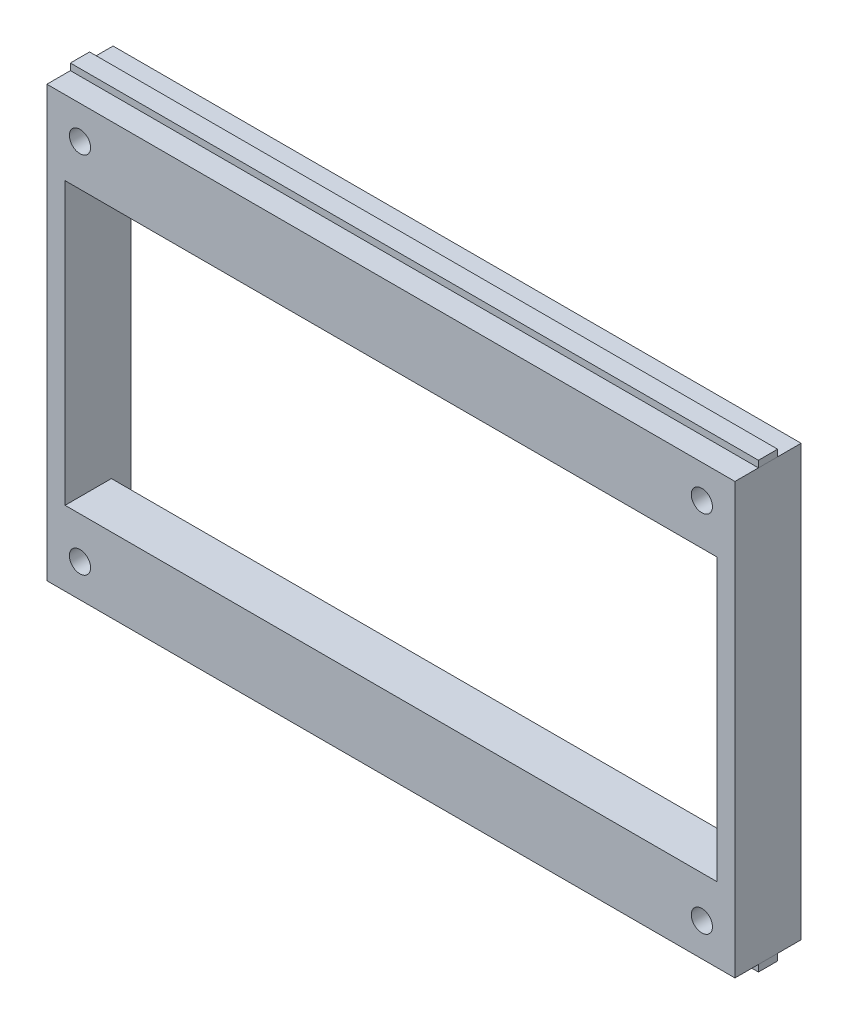
ISO-10303-21;
HEADER;
FILE_DESCRIPTION(('STEP AP214'),'2;1');
FILE_NAME('part.step','',(''),(''),'','','');
FILE_SCHEMA(('AUTOMOTIVE_DESIGN { 1 0 10303 214 1 1 1 1 }'));
ENDSEC;
DATA;
#1=APPLICATION_CONTEXT('core data for automotive mechanical design processes');
#2=APPLICATION_PROTOCOL_DEFINITION('international standard','automotive_design',2000,#1);
#3=PRODUCT_CONTEXT('',#1,'mechanical');
#4=PRODUCT('Part','Part','',(#3));
#5=PRODUCT_RELATED_PRODUCT_CATEGORY('part','',(#4));
#6=PRODUCT_DEFINITION_FORMATION('','',#4);
#7=PRODUCT_DEFINITION_CONTEXT('part definition',#1,'design');
#8=PRODUCT_DEFINITION('design','',#6,#7);
#9=PRODUCT_DEFINITION_SHAPE('','',#8);
#10=(LENGTH_UNIT() NAMED_UNIT(*) SI_UNIT(.MILLI.,.METRE.));
#11=(NAMED_UNIT(*) PLANE_ANGLE_UNIT() SI_UNIT($,.RADIAN.));
#12=(NAMED_UNIT(*) SI_UNIT($,.STERADIAN.) SOLID_ANGLE_UNIT());
#13=UNCERTAINTY_MEASURE_WITH_UNIT(LENGTH_MEASURE(1.E-05),#10,'distance_accuracy_value','');
#14=(GEOMETRIC_REPRESENTATION_CONTEXT(3) GLOBAL_UNCERTAINTY_ASSIGNED_CONTEXT((#13)) GLOBAL_UNIT_ASSIGNED_CONTEXT((#10,
#11,#12)) REPRESENTATION_CONTEXT('',''));
#15=CARTESIAN_POINT('',(0.,0.,0.));
#16=DIRECTION('',(0.,0.,1.));
#17=DIRECTION('',(1.,0.,0.));
#18=AXIS2_PLACEMENT_3D('',#15,#16,#17);
#19=CARTESIAN_POINT('',(55.0675723300356,-32.5,3.55000000000001));
#20=DIRECTION('',(0.,0.,-1.));
#21=DIRECTION('',(0.,1.,0.));
#22=AXIS2_PLACEMENT_3D('',#19,#20,#21);
#23=PLANE('',#22);
#24=DIRECTION('',(0.,1.,0.));
#25=VECTOR('',#24,1.);
#26=CARTESIAN_POINT('',(52.,-32.5,3.55000000000001));
#27=LINE('',#26,#25);
#28=CARTESIAN_POINT('',(52.,-33.5,3.55000000000001));
#29=VERTEX_POINT('',#28);
#30=CARTESIAN_POINT('',(52.,-32.5,3.55000000000001));
#31=VERTEX_POINT('',#30);
#32=EDGE_CURVE('E54',#29,#31,#27,.T.);
#33=ORIENTED_EDGE('',*,*,#32,.F.);
#34=DIRECTION('',(-1.,0.,0.));
#35=VECTOR('',#34,1.);
#36=CARTESIAN_POINT('',(55.0675723300356,-33.5,3.55000000000001));
#37=LINE('',#36,#35);
#38=CARTESIAN_POINT('',(-52.,-33.5,3.55000000000001));
#39=VERTEX_POINT('',#38);
#40=EDGE_CURVE('E82',#29,#39,#37,.T.);
#41=ORIENTED_EDGE('',*,*,#40,.T.);
#42=DIRECTION('',(0.,-1.,0.));
#43=VECTOR('',#42,1.);
#44=CARTESIAN_POINT('',(-52.,-32.5,3.55000000000001));
#45=LINE('',#44,#43);
#46=CARTESIAN_POINT('',(-52.,-32.5,3.55000000000001));
#47=VERTEX_POINT('',#46);
#48=EDGE_CURVE('E86',#47,#39,#45,.T.);
#49=ORIENTED_EDGE('',*,*,#48,.F.);
#50=DIRECTION('',(-1.,0.,0.));
#51=VECTOR('',#50,1.);
#52=CARTESIAN_POINT('',(55.0675723300356,-32.5,3.55000000000001));
#53=LINE('',#52,#51);
#54=EDGE_CURVE('E109',#31,#47,#53,.T.);
#55=ORIENTED_EDGE('',*,*,#54,.F.);
#56=EDGE_LOOP('',(#33,#41,#49,#55));
#57=FACE_BOUND('',#56,.T.);
#58=ADVANCED_FACE('F46',(#57),#23,.T.);
#59=CARTESIAN_POINT('',(55.0675723300356,-32.5,3.55000000000001));
#60=DIRECTION('',(0.,1.,0.));
#61=DIRECTION('',(-1.,0.,0.));
#62=AXIS2_PLACEMENT_3D('',#59,#60,#61);
#63=PLANE('',#62);
#64=DIRECTION('',(0.,0.,1.));
#65=VECTOR('',#64,1.);
#66=CARTESIAN_POINT('',(52.,-32.5,3.55000000000001));
#67=LINE('',#66,#65);
#68=CARTESIAN_POINT('',(52.,-32.5,6.45000000000001));
#69=VERTEX_POINT('',#68);
#70=EDGE_CURVE('E60',#31,#69,#67,.T.);
#71=ORIENTED_EDGE('',*,*,#70,.F.);
#72=ORIENTED_EDGE('',*,*,#54,.T.);
#73=DIRECTION('',(0.,0.,-1.));
#74=VECTOR('',#73,1.);
#75=CARTESIAN_POINT('',(-52.,-32.5,3.55000000000001));
#76=LINE('',#75,#74);
#77=CARTESIAN_POINT('',(-52.,-32.5,6.45000000000001));
#78=VERTEX_POINT('',#77);
#79=EDGE_CURVE('E91',#78,#47,#76,.T.);
#80=ORIENTED_EDGE('',*,*,#79,.F.);
#81=DIRECTION('',(-1.,0.,0.));
#82=VECTOR('',#81,1.);
#83=CARTESIAN_POINT('',(55.0675723300356,-32.5,6.45000000000001));
#84=LINE('',#83,#82);
#85=EDGE_CURVE('E112',#69,#78,#84,.T.);
#86=ORIENTED_EDGE('',*,*,#85,.F.);
#87=EDGE_LOOP('',(#71,#72,#80,#86));
#88=FACE_BOUND('',#87,.T.);
#89=ADVANCED_FACE('F118',(#88),#63,.T.);
#90=CARTESIAN_POINT('',(55.0675723300356,-32.5,6.45000000000001));
#91=DIRECTION('',(0.,0.,1.));
#92=DIRECTION('',(1.,0.,0.));
#93=AXIS2_PLACEMENT_3D('',#90,#91,#92);
#94=PLANE('',#93);
#95=DIRECTION('',(0.,-1.,0.));
#96=VECTOR('',#95,1.);
#97=CARTESIAN_POINT('',(52.,-32.5,6.45000000000001));
#98=LINE('',#97,#96);
#99=CARTESIAN_POINT('',(52.,-33.5,6.45000000000001));
#100=VERTEX_POINT('',#99);
#101=EDGE_CURVE('E111',#69,#100,#98,.T.);
#102=ORIENTED_EDGE('',*,*,#101,.F.);
#103=ORIENTED_EDGE('',*,*,#85,.T.);
#104=DIRECTION('',(0.,1.,0.));
#105=VECTOR('',#104,1.);
#106=CARTESIAN_POINT('',(-52.,-32.5,6.45000000000001));
#107=LINE('',#106,#105);
#108=CARTESIAN_POINT('',(-52.,-33.5,6.45000000000001));
#109=VERTEX_POINT('',#108);
#110=EDGE_CURVE('E99',#109,#78,#107,.T.);
#111=ORIENTED_EDGE('',*,*,#110,.F.);
#112=DIRECTION('',(-1.,0.,0.));
#113=VECTOR('',#112,1.);
#114=CARTESIAN_POINT('',(55.0675723300356,-33.5,6.45000000000001));
#115=LINE('',#114,#113);
#116=EDGE_CURVE('E90',#100,#109,#115,.T.);
#117=ORIENTED_EDGE('',*,*,#116,.F.);
#118=EDGE_LOOP('',(#102,#103,#111,#117));
#119=FACE_BOUND('',#118,.T.);
#120=ADVANCED_FACE('F116',(#119),#94,.T.);
#121=CARTESIAN_POINT('',(55.0675723300356,-33.5,3.55000000000001));
#122=DIRECTION('',(0.,-1.,0.));
#123=DIRECTION('',(1.,0.,0.));
#124=AXIS2_PLACEMENT_3D('',#121,#122,#123);
#125=PLANE('',#124);
#126=DIRECTION('',(0.,0.,-1.));
#127=VECTOR('',#126,1.);
#128=CARTESIAN_POINT('',(52.,-33.5,3.55000000000001));
#129=LINE('',#128,#127);
#130=EDGE_CURVE('E13',#100,#29,#129,.T.);
#131=ORIENTED_EDGE('',*,*,#130,.F.);
#132=ORIENTED_EDGE('',*,*,#116,.T.);
#133=DIRECTION('',(0.,0.,1.));
#134=VECTOR('',#133,1.);
#135=CARTESIAN_POINT('',(-52.,-33.5,3.55000000000001));
#136=LINE('',#135,#134);
#137=EDGE_CURVE('E93',#39,#109,#136,.T.);
#138=ORIENTED_EDGE('',*,*,#137,.F.);
#139=ORIENTED_EDGE('',*,*,#40,.F.);
#140=EDGE_LOOP('',(#131,#132,#138,#139));
#141=FACE_BOUND('',#140,.T.);
#142=ADVANCED_FACE('F94',(#141),#125,.T.);
#143=CARTESIAN_POINT('',(-52.,0.,0.));
#144=DIRECTION('',(-1.,0.,0.));
#145=DIRECTION('',(0.,0.,1.));
#146=AXIS2_PLACEMENT_3D('',#143,#144,#145);
#147=PLANE('',#146);
#148=ORIENTED_EDGE('',*,*,#48,.T.);
#149=ORIENTED_EDGE('',*,*,#137,.T.);
#150=ORIENTED_EDGE('',*,*,#110,.T.);
#151=ORIENTED_EDGE('',*,*,#79,.T.);
#152=EDGE_LOOP('',(#148,#149,#150,#151));
#153=FACE_BOUND('',#152,.T.);
#154=ADVANCED_FACE('F101',(#153),#147,.T.);
#155=CARTESIAN_POINT('',(52.,32.5,10.));
#156=DIRECTION('',(-1.,0.,0.));
#157=DIRECTION('',(0.,0.,1.));
#158=AXIS2_PLACEMENT_3D('',#155,#156,#157);
#159=PLANE('',#158);
#160=ORIENTED_EDGE('',*,*,#32,.T.);
#161=ORIENTED_EDGE('',*,*,#70,.T.);
#162=ORIENTED_EDGE('',*,*,#101,.T.);
#163=ORIENTED_EDGE('',*,*,#130,.T.);
#164=EDGE_LOOP('',(#160,#161,#162,#163));
#165=FACE_BOUND('',#164,.T.);
#166=ADVANCED_FACE('F120',(#165),#159,.F.);
#167=CLOSED_SHELL('',(#58,#89,#120,#142,#154,#166));
#168=MANIFOLD_SOLID_BREP('B2',#167);
#169=CARTESIAN_POINT('',(55.0675723300356,33.5,6.45));
#170=DIRECTION('',(0.,0.,1.));
#171=DIRECTION('',(0.,-1.,0.));
#172=AXIS2_PLACEMENT_3D('',#169,#170,#171);
#173=PLANE('',#172);
#174=DIRECTION('',(0.,-1.,0.));
#175=VECTOR('',#174,1.);
#176=CARTESIAN_POINT('',(52.,33.5,6.45));
#177=LINE('',#176,#175);
#178=CARTESIAN_POINT('',(52.,33.5,6.45));
#179=VERTEX_POINT('',#178);
#180=CARTESIAN_POINT('',(52.,32.5,6.45));
#181=VERTEX_POINT('',#180);
#182=EDGE_CURVE('E187',#179,#181,#177,.T.);
#183=ORIENTED_EDGE('',*,*,#182,.F.);
#184=DIRECTION('',(-1.,0.,0.));
#185=VECTOR('',#184,1.);
#186=CARTESIAN_POINT('',(55.0675723300356,33.5,6.45));
#187=LINE('',#186,#185);
#188=CARTESIAN_POINT('',(-52.,33.5,6.45));
#189=VERTEX_POINT('',#188);
#190=EDGE_CURVE('E215',#179,#189,#187,.T.);
#191=ORIENTED_EDGE('',*,*,#190,.T.);
#192=DIRECTION('',(0.,1.,0.));
#193=VECTOR('',#192,1.);
#194=CARTESIAN_POINT('',(-52.,33.5,6.45));
#195=LINE('',#194,#193);
#196=CARTESIAN_POINT('',(-52.,32.5,6.45));
#197=VERTEX_POINT('',#196);
#198=EDGE_CURVE('E219',#197,#189,#195,.T.);
#199=ORIENTED_EDGE('',*,*,#198,.F.);
#200=DIRECTION('',(-1.,0.,0.));
#201=VECTOR('',#200,1.);
#202=CARTESIAN_POINT('',(55.0675723300356,32.5,6.45));
#203=LINE('',#202,#201);
#204=EDGE_CURVE('E242',#181,#197,#203,.T.);
#205=ORIENTED_EDGE('',*,*,#204,.F.);
#206=EDGE_LOOP('',(#183,#191,#199,#205));
#207=FACE_BOUND('',#206,.T.);
#208=ADVANCED_FACE('F179',(#207),#173,.T.);
#209=CARTESIAN_POINT('',(55.0675723300356,32.5,6.45));
#210=DIRECTION('',(0.,-1.,0.));
#211=DIRECTION('',(1.,0.,0.));
#212=AXIS2_PLACEMENT_3D('',#209,#210,#211);
#213=PLANE('',#212);
#214=DIRECTION('',(0.,0.,-1.));
#215=VECTOR('',#214,1.);
#216=CARTESIAN_POINT('',(52.,32.5,6.45));
#217=LINE('',#216,#215);
#218=CARTESIAN_POINT('',(52.,32.5,3.55));
#219=VERTEX_POINT('',#218);
#220=EDGE_CURVE('E193',#181,#219,#217,.T.);
#221=ORIENTED_EDGE('',*,*,#220,.F.);
#222=ORIENTED_EDGE('',*,*,#204,.T.);
#223=DIRECTION('',(0.,0.,1.));
#224=VECTOR('',#223,1.);
#225=CARTESIAN_POINT('',(-52.,32.5,6.45));
#226=LINE('',#225,#224);
#227=CARTESIAN_POINT('',(-52.,32.5,3.55));
#228=VERTEX_POINT('',#227);
#229=EDGE_CURVE('E224',#228,#197,#226,.T.);
#230=ORIENTED_EDGE('',*,*,#229,.F.);
#231=DIRECTION('',(-1.,0.,0.));
#232=VECTOR('',#231,1.);
#233=CARTESIAN_POINT('',(55.0675723300356,32.5,3.55));
#234=LINE('',#233,#232);
#235=EDGE_CURVE('E245',#219,#228,#234,.T.);
#236=ORIENTED_EDGE('',*,*,#235,.F.);
#237=EDGE_LOOP('',(#221,#222,#230,#236));
#238=FACE_BOUND('',#237,.T.);
#239=ADVANCED_FACE('F251',(#238),#213,.T.);
#240=CARTESIAN_POINT('',(55.0675723300356,33.5,3.55));
#241=DIRECTION('',(0.,0.,-1.));
#242=DIRECTION('',(-1.,0.,0.));
#243=AXIS2_PLACEMENT_3D('',#240,#241,#242);
#244=PLANE('',#243);
#245=DIRECTION('',(0.,1.,0.));
#246=VECTOR('',#245,1.);
#247=CARTESIAN_POINT('',(52.,33.5,3.55));
#248=LINE('',#247,#246);
#249=CARTESIAN_POINT('',(52.,33.5,3.55));
#250=VERTEX_POINT('',#249);
#251=EDGE_CURVE('E244',#219,#250,#248,.T.);
#252=ORIENTED_EDGE('',*,*,#251,.F.);
#253=ORIENTED_EDGE('',*,*,#235,.T.);
#254=DIRECTION('',(0.,-1.,0.));
#255=VECTOR('',#254,1.);
#256=CARTESIAN_POINT('',(-52.,33.5,3.55));
#257=LINE('',#256,#255);
#258=CARTESIAN_POINT('',(-52.,33.5,3.55));
#259=VERTEX_POINT('',#258);
#260=EDGE_CURVE('E232',#259,#228,#257,.T.);
#261=ORIENTED_EDGE('',*,*,#260,.F.);
#262=DIRECTION('',(-1.,0.,0.));
#263=VECTOR('',#262,1.);
#264=CARTESIAN_POINT('',(55.0675723300356,33.5,3.55));
#265=LINE('',#264,#263);
#266=EDGE_CURVE('E223',#250,#259,#265,.T.);
#267=ORIENTED_EDGE('',*,*,#266,.F.);
#268=EDGE_LOOP('',(#252,#253,#261,#267));
#269=FACE_BOUND('',#268,.T.);
#270=ADVANCED_FACE('F249',(#269),#244,.T.);
#271=CARTESIAN_POINT('',(55.0675723300356,33.5,6.45));
#272=DIRECTION('',(0.,1.,0.));
#273=DIRECTION('',(-1.,0.,0.));
#274=AXIS2_PLACEMENT_3D('',#271,#272,#273);
#275=PLANE('',#274);
#276=DIRECTION('',(0.,0.,1.));
#277=VECTOR('',#276,1.);
#278=CARTESIAN_POINT('',(52.,33.5,6.45));
#279=LINE('',#278,#277);
#280=EDGE_CURVE('E44',#250,#179,#279,.T.);
#281=ORIENTED_EDGE('',*,*,#280,.F.);
#282=ORIENTED_EDGE('',*,*,#266,.T.);
#283=DIRECTION('',(0.,0.,-1.));
#284=VECTOR('',#283,1.);
#285=CARTESIAN_POINT('',(-52.,33.5,6.45));
#286=LINE('',#285,#284);
#287=EDGE_CURVE('E226',#189,#259,#286,.T.);
#288=ORIENTED_EDGE('',*,*,#287,.F.);
#289=ORIENTED_EDGE('',*,*,#190,.F.);
#290=EDGE_LOOP('',(#281,#282,#288,#289));
#291=FACE_BOUND('',#290,.T.);
#292=ADVANCED_FACE('F227',(#291),#275,.T.);
#293=CARTESIAN_POINT('',(-52.,0.,0.));
#294=DIRECTION('',(1.,0.,0.));
#295=DIRECTION('',(0.,0.,-1.));
#296=AXIS2_PLACEMENT_3D('',#293,#294,#295);
#297=PLANE('',#296);
#298=ORIENTED_EDGE('',*,*,#198,.T.);
#299=ORIENTED_EDGE('',*,*,#287,.T.);
#300=ORIENTED_EDGE('',*,*,#260,.T.);
#301=ORIENTED_EDGE('',*,*,#229,.T.);
#302=EDGE_LOOP('',(#298,#299,#300,#301));
#303=FACE_BOUND('',#302,.T.);
#304=ADVANCED_FACE('F234',(#303),#297,.F.);
#305=CARTESIAN_POINT('',(52.,32.5,10.));
#306=DIRECTION('',(-1.,0.,0.));
#307=DIRECTION('',(0.,0.,1.));
#308=AXIS2_PLACEMENT_3D('',#305,#306,#307);
#309=PLANE('',#308);
#310=ORIENTED_EDGE('',*,*,#182,.T.);
#311=ORIENTED_EDGE('',*,*,#220,.T.);
#312=ORIENTED_EDGE('',*,*,#251,.T.);
#313=ORIENTED_EDGE('',*,*,#280,.T.);
#314=EDGE_LOOP('',(#310,#311,#312,#313));
#315=FACE_BOUND('',#314,.T.);
#316=ADVANCED_FACE('F253',(#315),#309,.F.);
#317=CLOSED_SHELL('',(#208,#239,#270,#292,#304,#316));
#318=MANIFOLD_SOLID_BREP('B7',#317);
#319=CARTESIAN_POINT('',(-49.25,21.25,0.));
#320=DIRECTION('',(0.,1.,0.));
#321=DIRECTION('',(0.,0.,1.));
#322=AXIS2_PLACEMENT_3D('',#319,#320,#321);
#323=PLANE('',#322);
#324=DIRECTION('',(-1.,0.,0.));
#325=VECTOR('',#324,1.);
#326=CARTESIAN_POINT('',(-49.25,21.25,3.));
#327=LINE('',#326,#325);
#328=CARTESIAN_POINT('',(49.25,21.25,3.));
#329=VERTEX_POINT('',#328);
#330=CARTESIAN_POINT('',(-49.25,21.25,3.));
#331=VERTEX_POINT('',#330);
#332=EDGE_CURVE('E547',#329,#331,#327,.T.);
#333=ORIENTED_EDGE('',*,*,#332,.F.);
#334=DIRECTION('',(0.,0.,1.));
#335=VECTOR('',#334,1.);
#336=CARTESIAN_POINT('',(49.25,21.25,0.));
#337=LINE('',#336,#335);
#338=CARTESIAN_POINT('',(49.25,21.25,10.));
#339=VERTEX_POINT('',#338);
#340=EDGE_CURVE('E581',#329,#339,#337,.T.);
#341=ORIENTED_EDGE('',*,*,#340,.T.);
#342=DIRECTION('',(-1.,0.,0.));
#343=VECTOR('',#342,1.);
#344=CARTESIAN_POINT('',(-49.25,21.25,10.));
#345=LINE('',#344,#343);
#346=CARTESIAN_POINT('',(-49.25,21.25,10.));
#347=VERTEX_POINT('',#346);
#348=EDGE_CURVE('E565',#339,#347,#345,.T.);
#349=ORIENTED_EDGE('',*,*,#348,.T.);
#350=DIRECTION('',(0.,0.,1.));
#351=VECTOR('',#350,1.);
#352=CARTESIAN_POINT('',(-49.25,21.25,0.));
#353=LINE('',#352,#351);
#354=EDGE_CURVE('E578',#331,#347,#353,.T.);
#355=ORIENTED_EDGE('',*,*,#354,.F.);
#356=EDGE_LOOP('',(#333,#341,#349,#355));
#357=FACE_BOUND('',#356,.T.);
#358=ADVANCED_FACE('F303',(#357),#323,.F.);
#359=CARTESIAN_POINT('',(-49.25,-21.25,0.));
#360=DIRECTION('',(0.,-1.,0.));
#361=DIRECTION('',(0.,0.,-1.));
#362=AXIS2_PLACEMENT_3D('',#359,#360,#361);
#363=PLANE('',#362);
#364=DIRECTION('',(1.,0.,0.));
#365=VECTOR('',#364,1.);
#366=CARTESIAN_POINT('',(-49.25,-21.25,3.));
#367=LINE('',#366,#365);
#368=CARTESIAN_POINT('',(-49.25,-21.25,3.));
#369=VERTEX_POINT('',#368);
#370=CARTESIAN_POINT('',(49.25,-21.25,3.));
#371=VERTEX_POINT('',#370);
#372=EDGE_CURVE('E545',#369,#371,#367,.T.);
#373=ORIENTED_EDGE('',*,*,#372,.F.);
#374=DIRECTION('',(0.,0.,1.));
#375=VECTOR('',#374,1.);
#376=CARTESIAN_POINT('',(-49.25,-21.25,0.));
#377=LINE('',#376,#375);
#378=CARTESIAN_POINT('',(-49.25,-21.25,10.));
#379=VERTEX_POINT('',#378);
#380=EDGE_CURVE('E567',#369,#379,#377,.T.);
#381=ORIENTED_EDGE('',*,*,#380,.T.);
#382=DIRECTION('',(1.,0.,0.));
#383=VECTOR('',#382,1.);
#384=CARTESIAN_POINT('',(-49.25,-21.25,10.));
#385=LINE('',#384,#383);
#386=CARTESIAN_POINT('',(49.25,-21.25,10.));
#387=VERTEX_POINT('',#386);
#388=EDGE_CURVE('E570',#379,#387,#385,.T.);
#389=ORIENTED_EDGE('',*,*,#388,.T.);
#390=DIRECTION('',(0.,0.,1.));
#391=VECTOR('',#390,1.);
#392=CARTESIAN_POINT('',(49.25,-21.25,0.));
#393=LINE('',#392,#391);
#394=EDGE_CURVE('E583',#371,#387,#393,.T.);
#395=ORIENTED_EDGE('',*,*,#394,.F.);
#396=EDGE_LOOP('',(#373,#381,#389,#395));
#397=FACE_BOUND('',#396,.T.);
#398=ADVANCED_FACE('F639',(#397),#363,.F.);
#399=CARTESIAN_POINT('',(-47.,27.5,0.));
#400=DIRECTION('',(0.,0.,1.));
#401=DIRECTION('',(1.,0.,0.));
#402=AXIS2_PLACEMENT_3D('',#399,#400,#401);
#403=CYLINDRICAL_SURFACE('',#402,1.6);
#404=CARTESIAN_POINT('',(-47.,27.5,10.));
#405=DIRECTION('',(0.,0.,1.));
#406=DIRECTION('',(1.,0.,0.));
#407=AXIS2_PLACEMENT_3D('',#404,#405,#406);
#408=CIRCLE('',#407,1.6);
#409=CARTESIAN_POINT('',(-45.4,27.5,10.));
#410=VERTEX_POINT('',#409);
#411=EDGE_CURVE('E553',#410,#410,#408,.T.);
#412=ORIENTED_EDGE('',*,*,#411,.T.);
#413=EDGE_LOOP('',(#412));
#414=FACE_BOUND('',#413,.T.);
#415=CARTESIAN_POINT('',(-47.,27.5,3.));
#416=DIRECTION('',(0.,0.,-1.));
#417=DIRECTION('',(-1.,0.,0.));
#418=AXIS2_PLACEMENT_3D('',#415,#416,#417);
#419=CIRCLE('',#418,1.6);
#420=CARTESIAN_POINT('',(-48.6,27.5,3.));
#421=VERTEX_POINT('',#420);
#422=EDGE_CURVE('E542',#421,#421,#419,.F.);
#423=ORIENTED_EDGE('',*,*,#422,.F.);
#424=EDGE_LOOP('',(#423));
#425=FACE_BOUND('',#424,.T.);
#426=ADVANCED_FACE('F645',(#414,#425),#403,.F.);
#427=CARTESIAN_POINT('',(47.,-27.5,0.));
#428=DIRECTION('',(0.,0.,1.));
#429=DIRECTION('',(1.,0.,0.));
#430=AXIS2_PLACEMENT_3D('',#427,#428,#429);
#431=CYLINDRICAL_SURFACE('',#430,1.6);
#432=CARTESIAN_POINT('',(47.,-27.5,10.));
#433=DIRECTION('',(0.,0.,1.));
#434=DIRECTION('',(1.,0.,0.));
#435=AXIS2_PLACEMENT_3D('',#432,#433,#434);
#436=CIRCLE('',#435,1.6);
#437=CARTESIAN_POINT('',(48.6,-27.5,10.));
#438=VERTEX_POINT('',#437);
#439=EDGE_CURVE('E549',#438,#438,#436,.T.);
#440=ORIENTED_EDGE('',*,*,#439,.T.);
#441=EDGE_LOOP('',(#440));
#442=FACE_BOUND('',#441,.T.);
#443=CARTESIAN_POINT('',(47.,-27.5,3.));
#444=DIRECTION('',(0.,0.,-1.));
#445=DIRECTION('',(-1.,0.,0.));
#446=AXIS2_PLACEMENT_3D('',#443,#444,#445);
#447=CIRCLE('',#446,1.6);
#448=CARTESIAN_POINT('',(45.4,-27.5,3.));
#449=VERTEX_POINT('',#448);
#450=EDGE_CURVE('E539',#449,#449,#447,.F.);
#451=ORIENTED_EDGE('',*,*,#450,.F.);
#452=EDGE_LOOP('',(#451));
#453=FACE_BOUND('',#452,.T.);
#454=ADVANCED_FACE('F834',(#442,#453),#431,.F.);
#455=CARTESIAN_POINT('',(-47.,-27.5,0.));
#456=DIRECTION('',(0.,0.,1.));
#457=DIRECTION('',(1.,0.,0.));
#458=AXIS2_PLACEMENT_3D('',#455,#456,#457);
#459=CYLINDRICAL_SURFACE('',#458,1.6);
#460=CARTESIAN_POINT('',(-47.,-27.5,10.));
#461=DIRECTION('',(0.,0.,1.));
#462=DIRECTION('',(1.,0.,0.));
#463=AXIS2_PLACEMENT_3D('',#460,#461,#462);
#464=CIRCLE('',#463,1.6);
#465=CARTESIAN_POINT('',(-45.4,-27.5,10.));
#466=VERTEX_POINT('',#465);
#467=EDGE_CURVE('E554',#466,#466,#464,.T.);
#468=ORIENTED_EDGE('',*,*,#467,.T.);
#469=EDGE_LOOP('',(#468));
#470=FACE_BOUND('',#469,.T.);
#471=CARTESIAN_POINT('',(-47.,-27.5,3.));
#472=DIRECTION('',(0.,0.,-1.));
#473=DIRECTION('',(-1.,0.,0.));
#474=AXIS2_PLACEMENT_3D('',#471,#472,#473);
#475=CIRCLE('',#474,1.6);
#476=CARTESIAN_POINT('',(-48.6,-27.5,3.));
#477=VERTEX_POINT('',#476);
#478=EDGE_CURVE('E536',#477,#477,#475,.F.);
#479=ORIENTED_EDGE('',*,*,#478,.F.);
#480=EDGE_LOOP('',(#479));
#481=FACE_BOUND('',#480,.T.);
#482=ADVANCED_FACE('F842',(#470,#481),#459,.F.);
#483=CARTESIAN_POINT('',(47.,27.5,0.));
#484=DIRECTION('',(0.,0.,1.));
#485=DIRECTION('',(1.,0.,0.));
#486=AXIS2_PLACEMENT_3D('',#483,#484,#485);
#487=CYLINDRICAL_SURFACE('',#486,1.6);
#488=CARTESIAN_POINT('',(47.,27.5,10.));
#489=DIRECTION('',(0.,0.,1.));
#490=DIRECTION('',(1.,0.,0.));
#491=AXIS2_PLACEMENT_3D('',#488,#489,#490);
#492=CIRCLE('',#491,1.6);
#493=CARTESIAN_POINT('',(48.6,27.5,10.));
#494=VERTEX_POINT('',#493);
#495=EDGE_CURVE('E550',#494,#494,#492,.T.);
#496=ORIENTED_EDGE('',*,*,#495,.T.);
#497=EDGE_LOOP('',(#496));
#498=FACE_BOUND('',#497,.T.);
#499=CARTESIAN_POINT('',(47.,27.5,3.));
#500=DIRECTION('',(0.,0.,-1.));
#501=DIRECTION('',(-1.,0.,0.));
#502=AXIS2_PLACEMENT_3D('',#499,#500,#501);
#503=CIRCLE('',#502,1.6);
#504=CARTESIAN_POINT('',(45.4,27.5,3.));
#505=VERTEX_POINT('',#504);
#506=EDGE_CURVE('E307',#505,#505,#503,.F.);
#507=ORIENTED_EDGE('',*,*,#506,.F.);
#508=EDGE_LOOP('',(#507));
#509=FACE_BOUND('',#508,.T.);
#510=ADVANCED_FACE('F637',(#498,#509),#487,.F.);
#511=CARTESIAN_POINT('',(-52.,32.5,10.));
#512=DIRECTION('',(1.,0.,0.));
#513=DIRECTION('',(0.,1.,0.));
#514=AXIS2_PLACEMENT_3D('',#511,#512,#513);
#515=PLANE('',#514);
#516=DIRECTION('',(0.,-1.,0.));
#517=VECTOR('',#516,1.);
#518=CARTESIAN_POINT('',(-52.,32.5,0.));
#519=LINE('',#518,#517);
#520=CARTESIAN_POINT('',(-52.,32.5,0.));
#521=VERTEX_POINT('',#520);
#522=CARTESIAN_POINT('',(-52.,-32.5,0.));
#523=VERTEX_POINT('',#522);
#524=EDGE_CURVE('E580',#521,#523,#519,.T.);
#525=ORIENTED_EDGE('',*,*,#524,.T.);
#526=DIRECTION('',(0.,0.,-1.));
#527=VECTOR('',#526,1.);
#528=CARTESIAN_POINT('',(-52.,-32.5,10.));
#529=LINE('',#528,#527);
#530=CARTESIAN_POINT('',(-52.,-32.5,10.));
#531=VERTEX_POINT('',#530);
#532=EDGE_CURVE('E177',#531,#523,#529,.T.);
#533=ORIENTED_EDGE('',*,*,#532,.F.);
#534=DIRECTION('',(0.,-1.,0.));
#535=VECTOR('',#534,1.);
#536=CARTESIAN_POINT('',(-52.,32.5,10.));
#537=LINE('',#536,#535);
#538=CARTESIAN_POINT('',(-52.,32.5,10.));
#539=VERTEX_POINT('',#538);
#540=EDGE_CURVE('E586',#539,#531,#537,.T.);
#541=ORIENTED_EDGE('',*,*,#540,.F.);
#542=DIRECTION('',(0.,0.,-1.));
#543=VECTOR('',#542,1.);
#544=CARTESIAN_POINT('',(-52.,32.5,10.));
#545=LINE('',#544,#543);
#546=EDGE_CURVE('E596',#539,#521,#545,.T.);
#547=ORIENTED_EDGE('',*,*,#546,.T.);
#548=EDGE_LOOP('',(#525,#533,#541,#547));
#549=FACE_BOUND('',#548,.T.);
#550=ADVANCED_FACE('F305',(#549),#515,.F.);
#551=CARTESIAN_POINT('',(-52.,-32.5,10.));
#552=DIRECTION('',(0.,1.,0.));
#553=DIRECTION('',(0.,0.,1.));
#554=AXIS2_PLACEMENT_3D('',#551,#552,#553);
#555=PLANE('',#554);
#556=DIRECTION('',(1.,0.,0.));
#557=VECTOR('',#556,1.);
#558=CARTESIAN_POINT('',(-52.,-32.5,0.));
#559=LINE('',#558,#557);
#560=CARTESIAN_POINT('',(52.,-32.5,0.));
#561=VERTEX_POINT('',#560);
#562=EDGE_CURVE('E599',#523,#561,#559,.T.);
#563=ORIENTED_EDGE('',*,*,#562,.T.);
#564=DIRECTION('',(0.,0.,-1.));
#565=VECTOR('',#564,1.);
#566=CARTESIAN_POINT('',(52.,-32.5,10.));
#567=LINE('',#566,#565);
#568=CARTESIAN_POINT('',(52.,-32.5,10.));
#569=VERTEX_POINT('',#568);
#570=EDGE_CURVE('E312',#569,#561,#567,.T.);
#571=ORIENTED_EDGE('',*,*,#570,.F.);
#572=DIRECTION('',(1.,0.,0.));
#573=VECTOR('',#572,1.);
#574=CARTESIAN_POINT('',(-52.,-32.5,10.));
#575=LINE('',#574,#573);
#576=EDGE_CURVE('E589',#531,#569,#575,.T.);
#577=ORIENTED_EDGE('',*,*,#576,.F.);
#578=ORIENTED_EDGE('',*,*,#532,.T.);
#579=EDGE_LOOP('',(#563,#571,#577,#578));
#580=FACE_BOUND('',#579,.T.);
#581=ADVANCED_FACE('F630',(#580),#555,.F.);
#582=CARTESIAN_POINT('',(52.,32.5,10.));
#583=DIRECTION('',(-1.,0.,0.));
#584=DIRECTION('',(0.,0.,1.));
#585=AXIS2_PLACEMENT_3D('',#582,#583,#584);
#586=PLANE('',#585);
#587=DIRECTION('',(0.,1.,0.));
#588=VECTOR('',#587,1.);
#589=CARTESIAN_POINT('',(52.,32.5,0.));
#590=LINE('',#589,#588);
#591=CARTESIAN_POINT('',(52.,32.5,0.));
#592=VERTEX_POINT('',#591);
#593=EDGE_CURVE('E601',#561,#592,#590,.T.);
#594=ORIENTED_EDGE('',*,*,#593,.T.);
#595=DIRECTION('',(0.,0.,-1.));
#596=VECTOR('',#595,1.);
#597=CARTESIAN_POINT('',(52.,32.5,10.));
#598=LINE('',#597,#596);
#599=CARTESIAN_POINT('',(52.,32.5,10.));
#600=VERTEX_POINT('',#599);
#601=EDGE_CURVE('E606',#600,#592,#598,.T.);
#602=ORIENTED_EDGE('',*,*,#601,.F.);
#603=DIRECTION('',(0.,1.,0.));
#604=VECTOR('',#603,1.);
#605=CARTESIAN_POINT('',(52.,32.5,10.));
#606=LINE('',#605,#604);
#607=EDGE_CURVE('E592',#569,#600,#606,.T.);
#608=ORIENTED_EDGE('',*,*,#607,.F.);
#609=ORIENTED_EDGE('',*,*,#570,.T.);
#610=EDGE_LOOP('',(#594,#602,#608,#609));
#611=FACE_BOUND('',#610,.T.);
#612=ADVANCED_FACE('F614',(#611),#586,.F.);
#613=CARTESIAN_POINT('',(-52.,32.5,10.));
#614=DIRECTION('',(0.,-1.,0.));
#615=DIRECTION('',(0.,0.,-1.));
#616=AXIS2_PLACEMENT_3D('',#613,#614,#615);
#617=PLANE('',#616);
#618=DIRECTION('',(-1.,0.,0.));
#619=VECTOR('',#618,1.);
#620=CARTESIAN_POINT('',(-52.,32.5,0.));
#621=LINE('',#620,#619);
#622=EDGE_CURVE('E590',#592,#521,#621,.T.);
#623=ORIENTED_EDGE('',*,*,#622,.T.);
#624=ORIENTED_EDGE('',*,*,#546,.F.);
#625=DIRECTION('',(-1.,0.,0.));
#626=VECTOR('',#625,1.);
#627=CARTESIAN_POINT('',(-52.,32.5,10.));
#628=LINE('',#627,#626);
#629=EDGE_CURVE('E594',#600,#539,#628,.T.);
#630=ORIENTED_EDGE('',*,*,#629,.F.);
#631=ORIENTED_EDGE('',*,*,#601,.T.);
#632=EDGE_LOOP('',(#623,#624,#630,#631));
#633=FACE_BOUND('',#632,.T.);
#634=ADVANCED_FACE('F623',(#633),#617,.F.);
#635=CARTESIAN_POINT('',(0.,0.,10.));
#636=DIRECTION('',(0.,0.,1.));
#637=DIRECTION('',(1.,0.,0.));
#638=AXIS2_PLACEMENT_3D('',#635,#636,#637);
#639=PLANE('',#638);
#640=ORIENTED_EDGE('',*,*,#495,.F.);
#641=EDGE_LOOP('',(#640));
#642=FACE_BOUND('',#641,.T.);
#643=ORIENTED_EDGE('',*,*,#467,.F.);
#644=EDGE_LOOP('',(#643));
#645=FACE_BOUND('',#644,.T.);
#646=ORIENTED_EDGE('',*,*,#439,.F.);
#647=EDGE_LOOP('',(#646));
#648=FACE_BOUND('',#647,.T.);
#649=ORIENTED_EDGE('',*,*,#411,.F.);
#650=EDGE_LOOP('',(#649));
#651=FACE_BOUND('',#650,.T.);
#652=DIRECTION('',(0.,-1.,0.));
#653=VECTOR('',#652,1.);
#654=CARTESIAN_POINT('',(-49.25,21.25,10.));
#655=LINE('',#654,#653);
#656=EDGE_CURVE('E561',#347,#379,#655,.T.);
#657=ORIENTED_EDGE('',*,*,#656,.F.);
#658=ORIENTED_EDGE('',*,*,#348,.F.);
#659=DIRECTION('',(0.,1.,0.));
#660=VECTOR('',#659,1.);
#661=CARTESIAN_POINT('',(49.25,21.25,10.));
#662=LINE('',#661,#660);
#663=EDGE_CURVE('E573',#387,#339,#662,.T.);
#664=ORIENTED_EDGE('',*,*,#663,.F.);
#665=ORIENTED_EDGE('',*,*,#388,.F.);
#666=EDGE_LOOP('',(#657,#658,#664,#665));
#667=FACE_BOUND('',#666,.T.);
#668=ORIENTED_EDGE('',*,*,#540,.T.);
#669=ORIENTED_EDGE('',*,*,#576,.T.);
#670=ORIENTED_EDGE('',*,*,#607,.T.);
#671=ORIENTED_EDGE('',*,*,#629,.T.);
#672=EDGE_LOOP('',(#668,#669,#670,#671));
#673=FACE_BOUND('',#672,.T.);
#674=ADVANCED_FACE('F629',(#642,#645,#648,#651,#667,#673),#639,.T.);
#675=CARTESIAN_POINT('',(0.,0.,0.));
#676=DIRECTION('',(0.,0.,1.));
#677=DIRECTION('',(1.,0.,0.));
#678=AXIS2_PLACEMENT_3D('',#675,#676,#677);
#679=PLANE('',#678);
#680=DIRECTION('',(0.,1.,0.));
#681=VECTOR('',#680,1.);
#682=CARTESIAN_POINT('',(49.25,21.25,0.));
#683=LINE('',#682,#681);
#684=CARTESIAN_POINT('',(49.25,-30.,0.));
#685=VERTEX_POINT('',#684);
#686=CARTESIAN_POINT('',(49.25,30.,0.));
#687=VERTEX_POINT('',#686);
#688=EDGE_CURVE('E564',#685,#687,#683,.T.);
#689=ORIENTED_EDGE('',*,*,#688,.T.);
#690=DIRECTION('',(1.,0.,0.));
#691=VECTOR('',#690,1.);
#692=CARTESIAN_POINT('',(49.25,30.,0.));
#693=LINE('',#692,#691);
#694=CARTESIAN_POINT('',(-49.25,30.,0.));
#695=VERTEX_POINT('',#694);
#696=EDGE_CURVE('E522',#695,#687,#693,.T.);
#697=ORIENTED_EDGE('',*,*,#696,.F.);
#698=DIRECTION('',(0.,-1.,0.));
#699=VECTOR('',#698,1.);
#700=CARTESIAN_POINT('',(-49.25,21.25,0.));
#701=LINE('',#700,#699);
#702=CARTESIAN_POINT('',(-49.25,-30.,0.));
#703=VERTEX_POINT('',#702);
#704=EDGE_CURVE('E562',#695,#703,#701,.T.);
#705=ORIENTED_EDGE('',*,*,#704,.T.);
#706=DIRECTION('',(-1.,0.,0.));
#707=VECTOR('',#706,1.);
#708=CARTESIAN_POINT('',(49.25,-30.,0.));
#709=LINE('',#708,#707);
#710=EDGE_CURVE('E501',#685,#703,#709,.T.);
#711=ORIENTED_EDGE('',*,*,#710,.F.);
#712=EDGE_LOOP('',(#689,#697,#705,#711));
#713=FACE_BOUND('',#712,.T.);
#714=ORIENTED_EDGE('',*,*,#524,.F.);
#715=ORIENTED_EDGE('',*,*,#622,.F.);
#716=ORIENTED_EDGE('',*,*,#593,.F.);
#717=ORIENTED_EDGE('',*,*,#562,.F.);
#718=EDGE_LOOP('',(#714,#715,#716,#717));
#719=FACE_BOUND('',#718,.T.);
#720=ADVANCED_FACE('F620',(#713,#719),#679,.F.);
#721=CARTESIAN_POINT('',(-49.25,21.25,0.));
#722=DIRECTION('',(-1.,0.,0.));
#723=DIRECTION('',(0.,0.,1.));
#724=AXIS2_PLACEMENT_3D('',#721,#722,#723);
#725=PLANE('',#724);
#726=ORIENTED_EDGE('',*,*,#704,.F.);
#727=DIRECTION('',(0.,0.,-1.));
#728=VECTOR('',#727,1.);
#729=CARTESIAN_POINT('',(-49.25,30.,3.));
#730=LINE('',#729,#728);
#731=CARTESIAN_POINT('',(-49.25,30.,3.));
#732=VERTEX_POINT('',#731);
#733=EDGE_CURVE('E528',#732,#695,#730,.T.);
#734=ORIENTED_EDGE('',*,*,#733,.F.);
#735=DIRECTION('',(0.,1.,0.));
#736=VECTOR('',#735,1.);
#737=CARTESIAN_POINT('',(-49.25,30.,3.));
#738=LINE('',#737,#736);
#739=EDGE_CURVE('E513',#331,#732,#738,.T.);
#740=ORIENTED_EDGE('',*,*,#739,.F.);
#741=ORIENTED_EDGE('',*,*,#354,.T.);
#742=ORIENTED_EDGE('',*,*,#656,.T.);
#743=ORIENTED_EDGE('',*,*,#380,.F.);
#744=CARTESIAN_POINT('',(-49.25,-30.,3.));
#745=VERTEX_POINT('',#744);
#746=EDGE_CURVE('E514',#745,#369,#738,.T.);
#747=ORIENTED_EDGE('',*,*,#746,.F.);
#748=DIRECTION('',(0.,0.,-1.));
#749=VECTOR('',#748,1.);
#750=CARTESIAN_POINT('',(-49.25,-30.,3.));
#751=LINE('',#750,#749);
#752=EDGE_CURVE('E531',#745,#703,#751,.T.);
#753=ORIENTED_EDGE('',*,*,#752,.T.);
#754=EDGE_LOOP('',(#726,#734,#740,#741,#742,#743,#747,#753));
#755=FACE_BOUND('',#754,.T.);
#756=ADVANCED_FACE('F655',(#755),#725,.F.);
#757=CARTESIAN_POINT('',(49.25,21.25,0.));
#758=DIRECTION('',(1.,0.,0.));
#759=DIRECTION('',(0.,0.,-1.));
#760=AXIS2_PLACEMENT_3D('',#757,#758,#759);
#761=PLANE('',#760);
#762=ORIENTED_EDGE('',*,*,#688,.F.);
#763=DIRECTION('',(0.,0.,-1.));
#764=VECTOR('',#763,1.);
#765=CARTESIAN_POINT('',(49.25,-30.,3.));
#766=LINE('',#765,#764);
#767=CARTESIAN_POINT('',(49.25,-30.,3.));
#768=VERTEX_POINT('',#767);
#769=EDGE_CURVE('E520',#768,#685,#766,.T.);
#770=ORIENTED_EDGE('',*,*,#769,.F.);
#771=DIRECTION('',(0.,-1.,0.));
#772=VECTOR('',#771,1.);
#773=CARTESIAN_POINT('',(49.25,30.,3.));
#774=LINE('',#773,#772);
#775=EDGE_CURVE('E510',#371,#768,#774,.T.);
#776=ORIENTED_EDGE('',*,*,#775,.F.);
#777=ORIENTED_EDGE('',*,*,#394,.T.);
#778=ORIENTED_EDGE('',*,*,#663,.T.);
#779=ORIENTED_EDGE('',*,*,#340,.F.);
#780=CARTESIAN_POINT('',(49.25,30.,3.));
#781=VERTEX_POINT('',#780);
#782=EDGE_CURVE('E507',#781,#329,#774,.T.);
#783=ORIENTED_EDGE('',*,*,#782,.F.);
#784=DIRECTION('',(0.,0.,-1.));
#785=VECTOR('',#784,1.);
#786=CARTESIAN_POINT('',(49.25,30.,3.));
#787=LINE('',#786,#785);
#788=EDGE_CURVE('E525',#781,#687,#787,.T.);
#789=ORIENTED_EDGE('',*,*,#788,.T.);
#790=EDGE_LOOP('',(#762,#770,#776,#777,#778,#779,#783,#789));
#791=FACE_BOUND('',#790,.T.);
#792=ADVANCED_FACE('F652',(#791),#761,.F.);
#793=CARTESIAN_POINT('',(0.,0.,3.));
#794=DIRECTION('',(0.,0.,-1.));
#795=DIRECTION('',(-1.,0.,0.));
#796=AXIS2_PLACEMENT_3D('',#793,#794,#795);
#797=PLANE('',#796);
#798=DIRECTION('',(0.,-1.,0.));
#799=VECTOR('',#798,1.);
#800=CARTESIAN_POINT('',(44.,25.,3.));
#801=LINE('',#800,#799);
#802=CARTESIAN_POINT('',(44.,30.,3.));
#803=VERTEX_POINT('',#802);
#804=CARTESIAN_POINT('',(44.,25.,3.));
#805=VERTEX_POINT('',#804);
#806=EDGE_CURVE('E476',#803,#805,#801,.T.);
#807=ORIENTED_EDGE('',*,*,#806,.F.);
#808=DIRECTION('',(1.,0.,0.));
#809=VECTOR('',#808,1.);
#810=CARTESIAN_POINT('',(49.25,30.,3.));
#811=LINE('',#810,#809);
#812=EDGE_CURVE('E516',#803,#781,#811,.T.);
#813=ORIENTED_EDGE('',*,*,#812,.T.);
#814=ORIENTED_EDGE('',*,*,#782,.T.);
#815=ORIENTED_EDGE('',*,*,#332,.T.);
#816=ORIENTED_EDGE('',*,*,#739,.T.);
#817=CARTESIAN_POINT('',(-44.,30.,3.));
#818=VERTEX_POINT('',#817);
#819=EDGE_CURVE('E517',#732,#818,#811,.T.);
#820=ORIENTED_EDGE('',*,*,#819,.T.);
#821=DIRECTION('',(0.,1.,0.));
#822=VECTOR('',#821,1.);
#823=CARTESIAN_POINT('',(-44.,25.,3.));
#824=LINE('',#823,#822);
#825=CARTESIAN_POINT('',(-44.,25.,3.));
#826=VERTEX_POINT('',#825);
#827=EDGE_CURVE('E327',#826,#818,#824,.T.);
#828=ORIENTED_EDGE('',*,*,#827,.F.);
#829=DIRECTION('',(-1.,0.,0.));
#830=VECTOR('',#829,1.);
#831=CARTESIAN_POINT('',(44.,25.,3.));
#832=LINE('',#831,#830);
#833=EDGE_CURVE('E495',#805,#826,#832,.T.);
#834=ORIENTED_EDGE('',*,*,#833,.F.);
#835=EDGE_LOOP('',(#807,#813,#814,#815,#816,#820,#828,#834));
#836=FACE_BOUND('',#835,.T.);
#837=ORIENTED_EDGE('',*,*,#422,.T.);
#838=EDGE_LOOP('',(#837));
#839=FACE_BOUND('',#838,.T.);
#840=ORIENTED_EDGE('',*,*,#506,.T.);
#841=EDGE_LOOP('',(#840));
#842=FACE_BOUND('',#841,.T.);
#843=ADVANCED_FACE('F654',(#836,#839,#842),#797,.T.);
#844=CARTESIAN_POINT('',(49.25,30.,3.));
#845=DIRECTION('',(0.,1.,0.));
#846=DIRECTION('',(0.,0.,1.));
#847=AXIS2_PLACEMENT_3D('',#844,#845,#846);
#848=PLANE('',#847);
#849=ORIENTED_EDGE('',*,*,#696,.T.);
#850=ORIENTED_EDGE('',*,*,#788,.F.);
#851=ORIENTED_EDGE('',*,*,#812,.F.);
#852=DIRECTION('',(0.,0.,-1.));
#853=VECTOR('',#852,1.);
#854=CARTESIAN_POINT('',(44.,30.,6.));
#855=LINE('',#854,#853);
#856=CARTESIAN_POINT('',(44.,30.,6.));
#857=VERTEX_POINT('',#856);
#858=EDGE_CURVE('E499',#857,#803,#855,.T.);
#859=ORIENTED_EDGE('',*,*,#858,.F.);
#860=DIRECTION('',(1.,0.,0.));
#861=VECTOR('',#860,1.);
#862=CARTESIAN_POINT('',(44.,30.,6.));
#863=LINE('',#862,#861);
#864=CARTESIAN_POINT('',(-44.,30.,6.));
#865=VERTEX_POINT('',#864);
#866=EDGE_CURVE('E489',#865,#857,#863,.T.);
#867=ORIENTED_EDGE('',*,*,#866,.F.);
#868=DIRECTION('',(0.,0.,-1.));
#869=VECTOR('',#868,1.);
#870=CARTESIAN_POINT('',(-44.,30.,6.));
#871=LINE('',#870,#869);
#872=EDGE_CURVE('E502',#865,#818,#871,.T.);
#873=ORIENTED_EDGE('',*,*,#872,.T.);
#874=ORIENTED_EDGE('',*,*,#819,.F.);
#875=ORIENTED_EDGE('',*,*,#733,.T.);
#876=EDGE_LOOP('',(#849,#850,#851,#859,#867,#873,#874,#875));
#877=FACE_BOUND('',#876,.T.);
#878=ADVANCED_FACE('F695',(#877),#848,.F.);
#879=DIRECTION('',(0.,-1.,0.));
#880=VECTOR('',#879,1.);
#881=CARTESIAN_POINT('',(44.,-30.,3.));
#882=LINE('',#881,#880);
#883=CARTESIAN_POINT('',(44.,-25.,3.));
#884=VERTEX_POINT('',#883);
#885=CARTESIAN_POINT('',(44.,-30.,3.));
#886=VERTEX_POINT('',#885);
#887=EDGE_CURVE('E319',#884,#886,#882,.T.);
#888=ORIENTED_EDGE('',*,*,#887,.F.);
#889=DIRECTION('',(1.,0.,0.));
#890=VECTOR('',#889,1.);
#891=CARTESIAN_POINT('',(44.,-25.,3.));
#892=LINE('',#891,#890);
#893=CARTESIAN_POINT('',(-44.,-25.,3.));
#894=VERTEX_POINT('',#893);
#895=EDGE_CURVE('E463',#894,#884,#892,.T.);
#896=ORIENTED_EDGE('',*,*,#895,.F.);
#897=DIRECTION('',(0.,1.,0.));
#898=VECTOR('',#897,1.);
#899=CARTESIAN_POINT('',(-44.,-30.,3.));
#900=LINE('',#899,#898);
#901=CARTESIAN_POINT('',(-44.,-30.,3.));
#902=VERTEX_POINT('',#901);
#903=EDGE_CURVE('E466',#902,#894,#900,.T.);
#904=ORIENTED_EDGE('',*,*,#903,.F.);
#905=DIRECTION('',(-1.,0.,0.));
#906=VECTOR('',#905,1.);
#907=CARTESIAN_POINT('',(49.25,-30.,3.));
#908=LINE('',#907,#906);
#909=EDGE_CURVE('E509',#902,#745,#908,.T.);
#910=ORIENTED_EDGE('',*,*,#909,.T.);
#911=ORIENTED_EDGE('',*,*,#746,.T.);
#912=ORIENTED_EDGE('',*,*,#372,.T.);
#913=ORIENTED_EDGE('',*,*,#775,.T.);
#914=EDGE_CURVE('E511',#768,#886,#908,.T.);
#915=ORIENTED_EDGE('',*,*,#914,.T.);
#916=EDGE_LOOP('',(#888,#896,#904,#910,#911,#912,#913,#915));
#917=FACE_BOUND('',#916,.T.);
#918=ORIENTED_EDGE('',*,*,#450,.T.);
#919=EDGE_LOOP('',(#918));
#920=FACE_BOUND('',#919,.T.);
#921=ORIENTED_EDGE('',*,*,#478,.T.);
#922=EDGE_LOOP('',(#921));
#923=FACE_BOUND('',#922,.T.);
#924=ADVANCED_FACE('F698',(#917,#920,#923),#797,.T.);
#925=CARTESIAN_POINT('',(49.25,-30.,3.));
#926=DIRECTION('',(0.,-1.,0.));
#927=DIRECTION('',(0.,0.,-1.));
#928=AXIS2_PLACEMENT_3D('',#925,#926,#927);
#929=PLANE('',#928);
#930=ORIENTED_EDGE('',*,*,#710,.T.);
#931=ORIENTED_EDGE('',*,*,#752,.F.);
#932=ORIENTED_EDGE('',*,*,#909,.F.);
#933=DIRECTION('',(0.,0.,-1.));
#934=VECTOR('',#933,1.);
#935=CARTESIAN_POINT('',(-44.,-30.,6.));
#936=LINE('',#935,#934);
#937=CARTESIAN_POINT('',(-44.,-30.,6.));
#938=VERTEX_POINT('',#937);
#939=EDGE_CURVE('E448',#938,#902,#936,.T.);
#940=ORIENTED_EDGE('',*,*,#939,.F.);
#941=DIRECTION('',(-1.,0.,0.));
#942=VECTOR('',#941,1.);
#943=CARTESIAN_POINT('',(44.,-30.,6.));
#944=LINE('',#943,#942);
#945=CARTESIAN_POINT('',(44.,-30.,6.));
#946=VERTEX_POINT('',#945);
#947=EDGE_CURVE('E452',#946,#938,#944,.T.);
#948=ORIENTED_EDGE('',*,*,#947,.F.);
#949=DIRECTION('',(0.,0.,-1.));
#950=VECTOR('',#949,1.);
#951=CARTESIAN_POINT('',(44.,-30.,6.));
#952=LINE('',#951,#950);
#953=EDGE_CURVE('E439',#946,#886,#952,.T.);
#954=ORIENTED_EDGE('',*,*,#953,.T.);
#955=ORIENTED_EDGE('',*,*,#914,.F.);
#956=ORIENTED_EDGE('',*,*,#769,.T.);
#957=EDGE_LOOP('',(#930,#931,#932,#940,#948,#954,#955,#956));
#958=FACE_BOUND('',#957,.T.);
#959=ADVANCED_FACE('F454',(#958),#929,.F.);
#960=CARTESIAN_POINT('',(44.,25.,6.));
#961=DIRECTION('',(1.,0.,0.));
#962=DIRECTION('',(0.,0.,-1.));
#963=AXIS2_PLACEMENT_3D('',#960,#961,#962);
#964=PLANE('',#963);
#965=ORIENTED_EDGE('',*,*,#806,.T.);
#966=DIRECTION('',(0.,0.,-1.));
#967=VECTOR('',#966,1.);
#968=CARTESIAN_POINT('',(44.,25.,6.));
#969=LINE('',#968,#967);
#970=CARTESIAN_POINT('',(44.,25.,6.));
#971=VERTEX_POINT('',#970);
#972=EDGE_CURVE('E492',#971,#805,#969,.T.);
#973=ORIENTED_EDGE('',*,*,#972,.F.);
#974=DIRECTION('',(0.,-1.,0.));
#975=VECTOR('',#974,1.);
#976=CARTESIAN_POINT('',(44.,25.,6.));
#977=LINE('',#976,#975);
#978=EDGE_CURVE('E480',#857,#971,#977,.T.);
#979=ORIENTED_EDGE('',*,*,#978,.F.);
#980=ORIENTED_EDGE('',*,*,#858,.T.);
#981=EDGE_LOOP('',(#965,#973,#979,#980));
#982=FACE_BOUND('',#981,.T.);
#983=ADVANCED_FACE('F717',(#982),#964,.F.);
#984=CARTESIAN_POINT('',(-44.,25.,6.));
#985=DIRECTION('',(-1.,0.,0.));
#986=DIRECTION('',(0.,0.,1.));
#987=AXIS2_PLACEMENT_3D('',#984,#985,#986);
#988=PLANE('',#987);
#989=ORIENTED_EDGE('',*,*,#827,.T.);
#990=ORIENTED_EDGE('',*,*,#872,.F.);
#991=DIRECTION('',(0.,1.,0.));
#992=VECTOR('',#991,1.);
#993=CARTESIAN_POINT('',(-44.,25.,6.));
#994=LINE('',#993,#992);
#995=CARTESIAN_POINT('',(-44.,25.,6.));
#996=VERTEX_POINT('',#995);
#997=EDGE_CURVE('E486',#996,#865,#994,.T.);
#998=ORIENTED_EDGE('',*,*,#997,.F.);
#999=DIRECTION('',(0.,0.,-1.));
#1000=VECTOR('',#999,1.);
#1001=CARTESIAN_POINT('',(-44.,25.,6.));
#1002=LINE('',#1001,#1000);
#1003=EDGE_CURVE('E504',#996,#826,#1002,.T.);
#1004=ORIENTED_EDGE('',*,*,#1003,.T.);
#1005=EDGE_LOOP('',(#989,#990,#998,#1004));
#1006=FACE_BOUND('',#1005,.T.);
#1007=ADVANCED_FACE('F724',(#1006),#988,.F.);
#1008=CARTESIAN_POINT('',(44.,25.,6.));
#1009=DIRECTION('',(0.,-1.,0.));
#1010=DIRECTION('',(0.,0.,-1.));
#1011=AXIS2_PLACEMENT_3D('',#1008,#1009,#1010);
#1012=PLANE('',#1011);
#1013=ORIENTED_EDGE('',*,*,#833,.T.);
#1014=ORIENTED_EDGE('',*,*,#1003,.F.);
#1015=DIRECTION('',(-1.,0.,0.));
#1016=VECTOR('',#1015,1.);
#1017=CARTESIAN_POINT('',(44.,25.,6.));
#1018=LINE('',#1017,#1016);
#1019=EDGE_CURVE('E483',#971,#996,#1018,.T.);
#1020=ORIENTED_EDGE('',*,*,#1019,.F.);
#1021=ORIENTED_EDGE('',*,*,#972,.T.);
#1022=EDGE_LOOP('',(#1013,#1014,#1020,#1021));
#1023=FACE_BOUND('',#1022,.T.);
#1024=ADVANCED_FACE('F732',(#1023),#1012,.F.);
#1025=CARTESIAN_POINT('',(0.,0.,6.));
#1026=DIRECTION('',(0.,0.,1.));
#1027=DIRECTION('',(1.,0.,0.));
#1028=AXIS2_PLACEMENT_3D('',#1025,#1026,#1027);
#1029=PLANE('',#1028);
#1030=ORIENTED_EDGE('',*,*,#978,.T.);
#1031=ORIENTED_EDGE('',*,*,#1019,.T.);
#1032=ORIENTED_EDGE('',*,*,#997,.T.);
#1033=ORIENTED_EDGE('',*,*,#866,.T.);
#1034=EDGE_LOOP('',(#1030,#1031,#1032,#1033));
#1035=FACE_BOUND('',#1034,.T.);
#1036=ADVANCED_FACE('F739',(#1035),#1029,.F.);
#1037=CARTESIAN_POINT('',(44.,-30.,6.));
#1038=DIRECTION('',(1.,0.,0.));
#1039=DIRECTION('',(0.,0.,-1.));
#1040=AXIS2_PLACEMENT_3D('',#1037,#1038,#1039);
#1041=PLANE('',#1040);
#1042=ORIENTED_EDGE('',*,*,#887,.T.);
#1043=ORIENTED_EDGE('',*,*,#953,.F.);
#1044=DIRECTION('',(0.,-1.,0.));
#1045=VECTOR('',#1044,1.);
#1046=CARTESIAN_POINT('',(44.,-30.,6.));
#1047=LINE('',#1046,#1045);
#1048=CARTESIAN_POINT('',(44.,-25.,6.));
#1049=VERTEX_POINT('',#1048);
#1050=EDGE_CURVE('E443',#1049,#946,#1047,.T.);
#1051=ORIENTED_EDGE('',*,*,#1050,.F.);
#1052=DIRECTION('',(0.,0.,-1.));
#1053=VECTOR('',#1052,1.);
#1054=CARTESIAN_POINT('',(44.,-25.,6.));
#1055=LINE('',#1054,#1053);
#1056=EDGE_CURVE('E474',#1049,#884,#1055,.T.);
#1057=ORIENTED_EDGE('',*,*,#1056,.T.);
#1058=EDGE_LOOP('',(#1042,#1043,#1051,#1057));
#1059=FACE_BOUND('',#1058,.T.);
#1060=ADVANCED_FACE('F441',(#1059),#1041,.F.);
#1061=CARTESIAN_POINT('',(44.,-25.,6.));
#1062=DIRECTION('',(0.,1.,0.));
#1063=DIRECTION('',(0.,0.,1.));
#1064=AXIS2_PLACEMENT_3D('',#1061,#1062,#1063);
#1065=PLANE('',#1064);
#1066=ORIENTED_EDGE('',*,*,#895,.T.);
#1067=ORIENTED_EDGE('',*,*,#1056,.F.);
#1068=DIRECTION('',(1.,0.,0.));
#1069=VECTOR('',#1068,1.);
#1070=CARTESIAN_POINT('',(44.,-25.,6.));
#1071=LINE('',#1070,#1069);
#1072=CARTESIAN_POINT('',(-44.,-25.,6.));
#1073=VERTEX_POINT('',#1072);
#1074=EDGE_CURVE('E449',#1073,#1049,#1071,.T.);
#1075=ORIENTED_EDGE('',*,*,#1074,.F.);
#1076=DIRECTION('',(0.,0.,-1.));
#1077=VECTOR('',#1076,1.);
#1078=CARTESIAN_POINT('',(-44.,-25.,6.));
#1079=LINE('',#1078,#1077);
#1080=EDGE_CURVE('E477',#1073,#894,#1079,.T.);
#1081=ORIENTED_EDGE('',*,*,#1080,.T.);
#1082=EDGE_LOOP('',(#1066,#1067,#1075,#1081));
#1083=FACE_BOUND('',#1082,.T.);
#1084=ADVANCED_FACE('F754',(#1083),#1065,.F.);
#1085=CARTESIAN_POINT('',(-44.,-30.,6.));
#1086=DIRECTION('',(-1.,0.,0.));
#1087=DIRECTION('',(0.,0.,1.));
#1088=AXIS2_PLACEMENT_3D('',#1085,#1086,#1087);
#1089=PLANE('',#1088);
#1090=ORIENTED_EDGE('',*,*,#903,.T.);
#1091=ORIENTED_EDGE('',*,*,#1080,.F.);
#1092=DIRECTION('',(0.,1.,0.));
#1093=VECTOR('',#1092,1.);
#1094=CARTESIAN_POINT('',(-44.,-30.,6.));
#1095=LINE('',#1094,#1093);
#1096=EDGE_CURVE('E459',#938,#1073,#1095,.T.);
#1097=ORIENTED_EDGE('',*,*,#1096,.F.);
#1098=ORIENTED_EDGE('',*,*,#939,.T.);
#1099=EDGE_LOOP('',(#1090,#1091,#1097,#1098));
#1100=FACE_BOUND('',#1099,.T.);
#1101=ADVANCED_FACE('F761',(#1100),#1089,.F.);
#1102=CARTESIAN_POINT('',(0.,0.,6.));
#1103=DIRECTION('',(0.,0.,1.));
#1104=DIRECTION('',(1.,0.,0.));
#1105=AXIS2_PLACEMENT_3D('',#1102,#1103,#1104);
#1106=PLANE('',#1105);
#1107=ORIENTED_EDGE('',*,*,#1050,.T.);
#1108=ORIENTED_EDGE('',*,*,#947,.T.);
#1109=ORIENTED_EDGE('',*,*,#1096,.T.);
#1110=ORIENTED_EDGE('',*,*,#1074,.T.);
#1111=EDGE_LOOP('',(#1107,#1108,#1109,#1110));
#1112=FACE_BOUND('',#1111,.T.);
#1113=ADVANCED_FACE('F461',(#1112),#1106,.F.);
#1114=CLOSED_SHELL('',(#358,#398,#426,#454,#482,#510,#550,#581,#612,#634,#674,#720,#756,#792,
#843,#878,#924,#959,#983,#1007,#1024,#1036,#1060,#1084,#1101,#1113));
#1115=MANIFOLD_SOLID_BREP('B38',#1114);
#1116=ADVANCED_BREP_SHAPE_REPRESENTATION('',(#18,#168,#318,#1115),#14);
#1117=SHAPE_DEFINITION_REPRESENTATION(#9,#1116);
ENDSEC;
END-ISO-10303-21;
